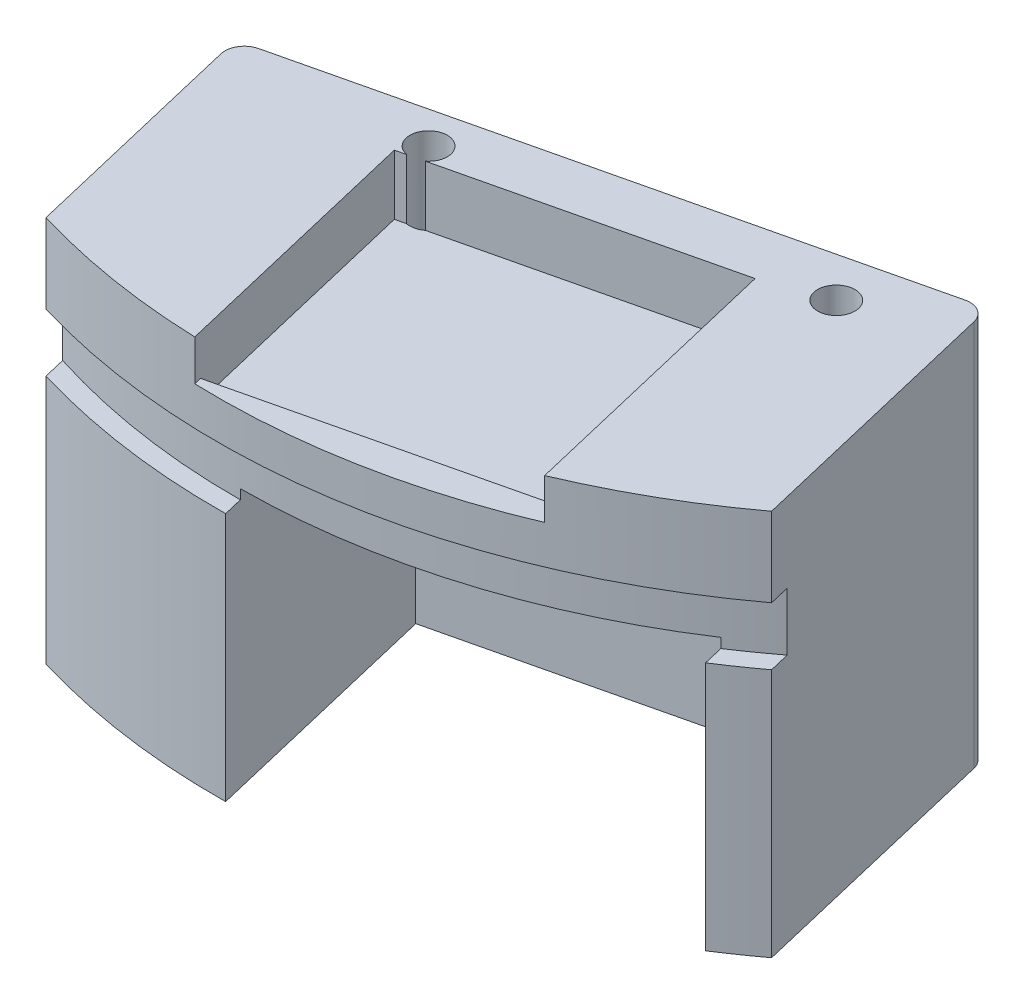
ISO-10303-21;
HEADER;
FILE_DESCRIPTION(('STEP AP214'),'2;1');
FILE_NAME('part.step','',(''),(''),'','','');
FILE_SCHEMA(('AUTOMOTIVE_DESIGN { 1 0 10303 214 1 1 1 1 }'));
ENDSEC;
DATA;
#1=APPLICATION_CONTEXT('core data for automotive mechanical design processes');
#2=APPLICATION_PROTOCOL_DEFINITION('international standard','automotive_design',2000,#1);
#3=PRODUCT_CONTEXT('',#1,'mechanical');
#4=PRODUCT('Part','Part','',(#3));
#5=PRODUCT_RELATED_PRODUCT_CATEGORY('part','',(#4));
#6=PRODUCT_DEFINITION_FORMATION('','',#4);
#7=PRODUCT_DEFINITION_CONTEXT('part definition',#1,'design');
#8=PRODUCT_DEFINITION('design','',#6,#7);
#9=PRODUCT_DEFINITION_SHAPE('','',#8);
#10=(LENGTH_UNIT() NAMED_UNIT(*) SI_UNIT(.MILLI.,.METRE.));
#11=(NAMED_UNIT(*) PLANE_ANGLE_UNIT() SI_UNIT($,.RADIAN.));
#12=(NAMED_UNIT(*) SI_UNIT($,.STERADIAN.) SOLID_ANGLE_UNIT());
#13=UNCERTAINTY_MEASURE_WITH_UNIT(LENGTH_MEASURE(1.E-05),#10,'distance_accuracy_value','');
#14=(GEOMETRIC_REPRESENTATION_CONTEXT(3) GLOBAL_UNCERTAINTY_ASSIGNED_CONTEXT((#13)) GLOBAL_UNIT_ASSIGNED_CONTEXT((#10,
#11,#12)) REPRESENTATION_CONTEXT('',''));
#15=CARTESIAN_POINT('',(0.,0.,0.));
#16=DIRECTION('',(0.,0.,1.));
#17=DIRECTION('',(1.,0.,0.));
#18=AXIS2_PLACEMENT_3D('',#15,#16,#17);
#19=CARTESIAN_POINT('',(0.,50.8,0.));
#20=DIRECTION('',(0.,-1.,0.));
#21=DIRECTION('',(0.,0.,-1.));
#22=AXIS2_PLACEMENT_3D('',#19,#20,#21);
#23=CYLINDRICAL_SURFACE('',#22,91.821);
#24=DIRECTION('',(0.,-1.,0.));
#25=VECTOR('',#24,1.);
#26=CARTESIAN_POINT('',(54.7427548097645,50.8,73.7178868175018));
#27=LINE('',#26,#25);
#28=CARTESIAN_POINT('',(54.7427548097645,0.,73.7178868175018));
#29=VERTEX_POINT('',#28);
#30=CARTESIAN_POINT('',(54.7427548097645,32.766,73.7178868175019));
#31=VERTEX_POINT('',#30);
#32=EDGE_CURVE('E366',#29,#31,#27,.F.);
#33=ORIENTED_EDGE('',*,*,#32,.T.);
#34=CARTESIAN_POINT('',(0.,32.766,0.));
#35=DIRECTION('',(0.,1.,0.));
#36=DIRECTION('',(0.,0.,1.));
#37=AXIS2_PLACEMENT_3D('',#34,#35,#36);
#38=CIRCLE('',#37,91.8210000000001);
#39=CARTESIAN_POINT('',(49.6178804361938,32.766,77.2603519408215));
#40=VERTEX_POINT('',#39);
#41=EDGE_CURVE('E436',#40,#31,#38,.T.);
#42=ORIENTED_EDGE('',*,*,#41,.F.);
#43=DIRECTION('',(0.,-1.,0.));
#44=VECTOR('',#43,1.);
#45=CARTESIAN_POINT('',(49.6178804361938,50.8,77.2603519408214));
#46=LINE('',#45,#44);
#47=CARTESIAN_POINT('',(49.6178804361938,0.,77.2603519408214));
#48=VERTEX_POINT('',#47);
#49=EDGE_CURVE('E302',#40,#48,#46,.T.);
#50=ORIENTED_EDGE('',*,*,#49,.T.);
#51=CARTESIAN_POINT('',(0.,0.,0.));
#52=DIRECTION('',(0.,1.,0.));
#53=DIRECTION('',(0.,0.,1.));
#54=AXIS2_PLACEMENT_3D('',#51,#52,#53);
#55=CIRCLE('',#54,91.821);
#56=EDGE_CURVE('E282',#48,#29,#55,.T.);
#57=ORIENTED_EDGE('',*,*,#56,.T.);
#58=EDGE_LOOP('',(#33,#42,#50,#57));
#59=FACE_BOUND('',#58,.T.);
#60=ADVANCED_FACE('F44',(#59),#23,.T.);
#61=DIRECTION('',(0.,-1.,0.));
#62=VECTOR('',#61,1.);
#63=CARTESIAN_POINT('',(1.12127287191595,50.8,91.814153528455));
#64=LINE('',#63,#62);
#65=CARTESIAN_POINT('',(1.12127287191595,0.,91.814153528455));
#66=VERTEX_POINT('',#65);
#67=CARTESIAN_POINT('',(1.12127287191597,32.766,91.8141535284551));
#68=VERTEX_POINT('',#67);
#69=EDGE_CURVE('E309',#66,#68,#64,.F.);
#70=ORIENTED_EDGE('',*,*,#69,.T.);
#71=CARTESIAN_POINT('',(-26.3260693042562,32.766,87.9660964007584));
#72=VERTEX_POINT('',#71);
#73=EDGE_CURVE('E437',#72,#68,#38,.T.);
#74=ORIENTED_EDGE('',*,*,#73,.F.);
#75=DIRECTION('',(0.,-1.,0.));
#76=VECTOR('',#75,1.);
#77=CARTESIAN_POINT('',(-26.3260693042562,50.8,87.9660964007583));
#78=LINE('',#77,#76);
#79=CARTESIAN_POINT('',(-26.3260693042562,0.,87.9660964007583));
#80=VERTEX_POINT('',#79);
#81=EDGE_CURVE('E274',#72,#80,#78,.T.);
#82=ORIENTED_EDGE('',*,*,#81,.T.);
#83=EDGE_CURVE('E279',#80,#66,#55,.T.);
#84=ORIENTED_EDGE('',*,*,#83,.T.);
#85=EDGE_LOOP('',(#70,#74,#82,#84));
#86=FACE_BOUND('',#85,.T.);
#87=ADVANCED_FACE('F536',(#86),#23,.T.);
#88=CARTESIAN_POINT('',(0.,34.036,0.));
#89=DIRECTION('',(0.,1.,0.));
#90=DIRECTION('',(0.,0.,1.));
#91=AXIS2_PLACEMENT_3D('',#88,#89,#90);
#92=PLANE('',#91);
#93=DIRECTION('',(0.970383203876007,0.,-0.241570771483919));
#94=VECTOR('',#93,1.);
#95=CARTESIAN_POINT('',(4.1266555424623,34.036,64.0245226491388));
#96=LINE('',#95,#94);
#97=CARTESIAN_POINT('',(4.1266555424623,34.036,64.0245226491387));
#98=VERTEX_POINT('',#97);
#99=CARTESIAN_POINT('',(32.4556101842239,34.036,56.9722082636378));
#100=VERTEX_POINT('',#99);
#101=EDGE_CURVE('E329',#98,#100,#96,.T.);
#102=ORIENTED_EDGE('',*,*,#101,.F.);
#103=DIRECTION('',(-0.241570771483919,0.,-0.970383203876007));
#104=VECTOR('',#103,1.);
#105=CARTESIAN_POINT('',(4.1266555424623,34.036,64.0245226491388));
#106=LINE('',#105,#104);
#107=CARTESIAN_POINT('',(8.08996538918475,34.036,79.9450302643238));
#108=VERTEX_POINT('',#107);
#109=EDGE_CURVE('E332',#108,#98,#106,.T.);
#110=ORIENTED_EDGE('',*,*,#109,.F.);
#111=DIRECTION('',(-0.970383203876007,0.,0.241570771483919));
#112=VECTOR('',#111,1.);
#113=CARTESIAN_POINT('',(8.08996538918475,34.036,79.9450302643238));
#114=LINE('',#113,#112);
#115=CARTESIAN_POINT('',(36.4189200309464,34.036,72.8927158788228));
#116=VERTEX_POINT('',#115);
#117=EDGE_CURVE('E322',#116,#108,#114,.T.);
#118=ORIENTED_EDGE('',*,*,#117,.F.);
#119=DIRECTION('',(0.241570771483918,0.,0.970383203876007));
#120=VECTOR('',#119,1.);
#121=CARTESIAN_POINT('',(32.4556101842239,34.036,56.9722082636378));
#122=LINE('',#121,#120);
#123=EDGE_CURVE('E326',#100,#116,#122,.T.);
#124=ORIENTED_EDGE('',*,*,#123,.F.);
#125=EDGE_LOOP('',(#102,#110,#118,#124));
#126=FACE_BOUND('',#125,.T.);
#127=DIRECTION('',(-0.230709787533386,0.,-0.973022607104429));
#128=VECTOR('',#127,1.);
#129=CARTESIAN_POINT('',(29.6330142903222,34.036,-7.02617429541416));
#130=LINE('',#129,#128);
#131=CARTESIAN_POINT('',(48.9956200304582,34.036,74.6359576801355));
#132=VERTEX_POINT('',#131);
#133=CARTESIAN_POINT('',(42.5422488990527,34.036,47.4187508592762));
#134=VERTEX_POINT('',#133);
#135=EDGE_CURVE('E295',#132,#134,#130,.T.);
#136=ORIENTED_EDGE('',*,*,#135,.F.);
#137=CARTESIAN_POINT('',(0.,34.036,0.));
#138=DIRECTION('',(0.,1.,0.));
#139=DIRECTION('',(0.,0.,1.));
#140=AXIS2_PLACEMENT_3D('',#137,#138,#139);
#141=CIRCLE('',#140,89.2810000000001);
#142=CARTESIAN_POINT('',(0.520286764385591,34.036,89.2794839965085));
#143=VERTEX_POINT('',#142);
#144=EDGE_CURVE('E433',#132,#143,#141,.F.);
#145=ORIENTED_EDGE('',*,*,#144,.T.);
#146=DIRECTION('',(0.230709787533386,0.,0.973022607104429));
#147=VECTOR('',#146,1.);
#148=CARTESIAN_POINT('',(-19.5493864083783,34.036,4.63528262524837));
#149=LINE('',#148,#147);
#150=CARTESIAN_POINT('',(-6.64015179964779,34.036,59.0802077799387));
#151=VERTEX_POINT('',#150);
#152=EDGE_CURVE('E292',#151,#143,#149,.T.);
#153=ORIENTED_EDGE('',*,*,#152,.F.);
#154=DIRECTION('',(-0.973022607104429,0.,0.230709787533386));
#155=VECTOR('',#154,1.);
#156=CARTESIAN_POINT('',(12.9092346087305,34.036,54.4449251546903));
#157=LINE('',#156,#155);
#158=EDGE_CURVE('E305',#134,#151,#157,.T.);
#159=ORIENTED_EDGE('',*,*,#158,.F.);
#160=EDGE_LOOP('',(#136,#145,#153,#159));
#161=FACE_BOUND('',#160,.T.);
#162=ADVANCED_FACE('F454',(#126,#161),#92,.F.);
#163=CARTESIAN_POINT('',(-3.21042467012304,42.926,90.7750141052591));
#164=DIRECTION('',(0.230709787533386,0.,0.973022607104429));
#165=DIRECTION('',(0.973022607104429,0.,-0.230709787533386));
#166=AXIS2_PLACEMENT_3D('',#163,#164,#165);
#167=PLANE('',#166);
#168=DIRECTION('',(-0.973022607104429,0.,0.230709787533386));
#169=VECTOR('',#168,1.);
#170=CARTESIAN_POINT('',(-3.21042467012304,45.466,90.7750141052591));
#171=LINE('',#170,#169);
#172=CARTESIAN_POINT('',(35.0974753715783,45.466,81.6919697700697));
#173=VERTEX_POINT('',#172);
#174=CARTESIAN_POINT('',(-3.21042467012304,45.466,90.7750141052591));
#175=VERTEX_POINT('',#174);
#176=EDGE_CURVE('E236',#173,#175,#171,.T.);
#177=ORIENTED_EDGE('',*,*,#176,.F.);
#178=DIRECTION('',(0.,1.,0.));
#179=VECTOR('',#178,1.);
#180=CARTESIAN_POINT('',(35.0974753715783,42.926,81.6919697700697));
#181=LINE('',#180,#179);
#182=CARTESIAN_POINT('',(35.0974753715783,42.926,81.6919697700697));
#183=VERTEX_POINT('',#182);
#184=EDGE_CURVE('E348',#183,#173,#181,.T.);
#185=ORIENTED_EDGE('',*,*,#184,.F.);
#186=DIRECTION('',(0.973022607104429,0.,-0.230709787533386));
#187=VECTOR('',#186,1.);
#188=CARTESIAN_POINT('',(-3.21042467012304,42.926,90.7750141052591));
#189=LINE('',#188,#187);
#190=CARTESIAN_POINT('',(-3.21042467012304,42.926,90.7750141052591));
#191=VERTEX_POINT('',#190);
#192=EDGE_CURVE('E373',#191,#183,#189,.T.);
#193=ORIENTED_EDGE('',*,*,#192,.F.);
#194=DIRECTION('',(0.,1.,0.));
#195=VECTOR('',#194,1.);
#196=CARTESIAN_POINT('',(-3.21042467012304,42.926,90.7750141052591));
#197=LINE('',#196,#195);
#198=EDGE_CURVE('E345',#191,#175,#197,.T.);
#199=ORIENTED_EDGE('',*,*,#198,.T.);
#200=EDGE_LOOP('',(#177,#185,#193,#199));
#201=FACE_BOUND('',#200,.T.);
#202=ADVANCED_FACE('F527',(#201),#167,.F.);
#203=CARTESIAN_POINT('',(27.1864367570585,42.926,48.3270245724588));
#204=DIRECTION('',(-0.230709787533387,0.,-0.973022607104429));
#205=DIRECTION('',(-0.973022607104429,0.,0.230709787533387));
#206=AXIS2_PLACEMENT_3D('',#203,#204,#205);
#207=PLANE('',#206);
#208=DIRECTION('',(-0.973022607104429,0.,0.230709787533387));
#209=VECTOR('',#208,1.);
#210=CARTESIAN_POINT('',(27.1864367570585,42.926,48.3270245724588));
#211=LINE('',#210,#209);
#212=CARTESIAN_POINT('',(-9.82608972966638,42.926,57.1029276804425));
#213=VERTEX_POINT('',#212);
#214=CARTESIAN_POINT('',(-11.1214632846429,42.926,57.4100689076483));
#215=VERTEX_POINT('',#214);
#216=EDGE_CURVE('E369',#213,#215,#211,.T.);
#217=ORIENTED_EDGE('',*,*,#216,.F.);
#218=DIRECTION('',(0.,1.,0.));
#219=VECTOR('',#218,1.);
#220=CARTESIAN_POINT('',(-9.82608972966639,50.8,57.1029276804425));
#221=LINE('',#220,#219);
#222=CARTESIAN_POINT('',(-9.82608972966639,50.8,57.1029276804425));
#223=VERTEX_POINT('',#222);
#224=EDGE_CURVE('E396',#213,#223,#221,.T.);
#225=ORIENTED_EDGE('',*,*,#224,.T.);
#226=DIRECTION('',(-0.973022607104429,0.,0.230709787533387));
#227=VECTOR('',#226,1.);
#228=CARTESIAN_POINT('',(27.1864367570585,50.8,48.3270245724588));
#229=LINE('',#228,#227);
#230=CARTESIAN_POINT('',(-11.1214632846429,50.8,57.4100689076483));
#231=VERTEX_POINT('',#230);
#232=EDGE_CURVE('E361',#223,#231,#229,.T.);
#233=ORIENTED_EDGE('',*,*,#232,.T.);
#234=DIRECTION('',(0.,1.,0.));
#235=VECTOR('',#234,1.);
#236=CARTESIAN_POINT('',(-11.1214632846429,42.926,57.4100689076483));
#237=LINE('',#236,#235);
#238=EDGE_CURVE('E334',#215,#231,#237,.T.);
#239=ORIENTED_EDGE('',*,*,#238,.F.);
#240=EDGE_LOOP('',(#217,#225,#233,#239));
#241=FACE_BOUND('',#240,.T.);
#242=ADVANCED_FACE('F509',(#241),#207,.F.);
#243=CARTESIAN_POINT('',(0.,0.,0.));
#244=DIRECTION('',(0.,1.,0.));
#245=DIRECTION('',(0.,0.,1.));
#246=AXIS2_PLACEMENT_3D('',#243,#244,#245);
#247=PLANE('',#246);
#248=CARTESIAN_POINT('',(-9.33617301887164,0.,54.6948076421172));
#249=DIRECTION('',(0.,1.,0.));
#250=DIRECTION('',(0.,0.,1.));
#251=AXIS2_PLACEMENT_3D('',#248,#249,#250);
#252=CIRCLE('',#251,2.45744999999998);
#253=CARTESIAN_POINT('',(-9.33617301887164,0.,57.1522576421172));
#254=VERTEX_POINT('',#253);
#255=EDGE_CURVE('E402',#254,#254,#252,.T.);
#256=ORIENTED_EDGE('',*,*,#255,.T.);
#257=EDGE_LOOP('',(#256));
#258=FACE_BOUND('',#257,.T.);
#259=CARTESIAN_POINT('',(34.9923344592376,0.,45.4676527439476));
#260=DIRECTION('',(0.,1.,0.));
#261=DIRECTION('',(0.,0.,1.));
#262=AXIS2_PLACEMENT_3D('',#259,#260,#261);
#263=CIRCLE('',#262,2.45744999999998);
#264=CARTESIAN_POINT('',(34.9923344592376,0.,47.9251027439476));
#265=VERTEX_POINT('',#264);
#266=EDGE_CURVE('E386',#265,#265,#263,.T.);
#267=ORIENTED_EDGE('',*,*,#266,.T.);
#268=EDGE_LOOP('',(#267));
#269=FACE_BOUND('',#268,.T.);
#270=DIRECTION('',(0.230709787533386,0.,0.973022607104429));
#271=VECTOR('',#270,1.);
#272=CARTESIAN_POINT('',(-35.8757033345835,0.,47.6903460720576));
#273=LINE('',#272,#271);
#274=CARTESIAN_POINT('',(-33.4730916072108,0.,57.8234035024431));
#275=VERTEX_POINT('',#274);
#276=EDGE_CURVE('E275',#275,#80,#273,.T.);
#277=ORIENTED_EDGE('',*,*,#276,.F.);
#278=CARTESIAN_POINT('',(-31.0016141851656,0.,57.2374006421082));
#279=DIRECTION('',(0.,1.,0.));
#280=DIRECTION('',(0.,0.,1.));
#281=AXIS2_PLACEMENT_3D('',#278,#279,#280);
#282=CIRCLE('',#281,2.54);
#283=CARTESIAN_POINT('',(-31.5876170455004,0.,54.765923220063));
#284=VERTEX_POINT('',#283);
#285=EDGE_CURVE('E262',#275,#284,#282,.F.);
#286=ORIENTED_EDGE('',*,*,#285,.T.);
#287=DIRECTION('',(0.973022607104429,0.,-0.230709787533386));
#288=VECTOR('',#287,1.);
#289=CARTESIAN_POINT('',(45.8932001356174,0.,36.3947335485672));
#290=LINE('',#289,#288);
#291=CARTESIAN_POINT('',(43.4217227135721,0.,36.980736408902));
#292=VERTEX_POINT('',#291);
#293=EDGE_CURVE('E382',#284,#292,#290,.T.);
#294=ORIENTED_EDGE('',*,*,#293,.T.);
#295=CARTESIAN_POINT('',(44.0077255739069,0.,39.4522138309473));
#296=DIRECTION('',(0.,1.,0.));
#297=DIRECTION('',(0.,0.,1.));
#298=AXIS2_PLACEMENT_3D('',#295,#296,#297);
#299=CIRCLE('',#298,2.54);
#300=CARTESIAN_POINT('',(46.4792029959521,0.,38.8662109706125));
#301=VERTEX_POINT('',#300);
#302=EDGE_CURVE('E264',#292,#301,#299,.F.);
#303=ORIENTED_EDGE('',*,*,#302,.T.);
#304=DIRECTION('',(0.230709787533386,0.,0.973022607104429));
#305=VECTOR('',#304,1.);
#306=CARTESIAN_POINT('',(45.8932001356174,0.,36.3947335485672));
#307=LINE('',#306,#305);
#308=EDGE_CURVE('E387',#301,#29,#307,.T.);
#309=ORIENTED_EDGE('',*,*,#308,.T.);
#310=ORIENTED_EDGE('',*,*,#56,.F.);
#311=DIRECTION('',(-0.230709787533386,0.,-0.973022607104429));
#312=VECTOR('',#311,1.);
#313=CARTESIAN_POINT('',(29.6330142903222,0.,-7.02617429541416));
#314=LINE('',#313,#312);
#315=CARTESIAN_POINT('',(42.5422488990527,0.,47.4187508592762));
#316=VERTEX_POINT('',#315);
#317=EDGE_CURVE('E299',#48,#316,#314,.T.);
#318=ORIENTED_EDGE('',*,*,#317,.T.);
#319=DIRECTION('',(-0.973022607104429,0.,0.230709787533386));
#320=VECTOR('',#319,1.);
#321=CARTESIAN_POINT('',(12.9092346087305,0.,54.4449251546903));
#322=LINE('',#321,#320);
#323=CARTESIAN_POINT('',(-6.64015179964779,0.,59.0802077799387));
#324=VERTEX_POINT('',#323);
#325=EDGE_CURVE('E296',#316,#324,#322,.T.);
#326=ORIENTED_EDGE('',*,*,#325,.T.);
#327=DIRECTION('',(0.230709787533386,0.,0.973022607104429));
#328=VECTOR('',#327,1.);
#329=CARTESIAN_POINT('',(-19.5493864083783,0.,4.63528262524837));
#330=LINE('',#329,#328);
#331=EDGE_CURVE('E293',#324,#66,#330,.T.);
#332=ORIENTED_EDGE('',*,*,#331,.T.);
#333=ORIENTED_EDGE('',*,*,#83,.F.);
#334=EDGE_LOOP('',(#277,#286,#294,#303,#309,#310,#318,#326,#332,#333));
#335=FACE_BOUND('',#334,.T.);
#336=ADVANCED_FACE('F534',(#258,#269,#335),#247,.F.);
#337=CARTESIAN_POINT('',(-26.3260693042562,50.8,87.9660964007583));
#338=VERTEX_POINT('',#337);
#339=CARTESIAN_POINT('',(-26.3260693042562,40.386,87.9660964007584));
#340=VERTEX_POINT('',#339);
#341=EDGE_CURVE('E271',#338,#340,#78,.T.);
#342=ORIENTED_EDGE('',*,*,#341,.T.);
#343=CARTESIAN_POINT('',(0.,40.386,0.));
#344=DIRECTION('',(0.,1.,0.));
#345=DIRECTION('',(0.,0.,1.));
#346=AXIS2_PLACEMENT_3D('',#343,#344,#345);
#347=CIRCLE('',#346,91.8210000000001);
#348=CARTESIAN_POINT('',(54.7427548097646,40.386,73.7178868175019));
#349=VERTEX_POINT('',#348);
#350=EDGE_CURVE('E243',#340,#349,#347,.T.);
#351=ORIENTED_EDGE('',*,*,#350,.T.);
#352=CARTESIAN_POINT('',(54.7427548097645,50.8,73.7178868175018));
#353=VERTEX_POINT('',#352);
#354=EDGE_CURVE('E248',#349,#353,#27,.F.);
#355=ORIENTED_EDGE('',*,*,#354,.T.);
#356=CARTESIAN_POINT('',(0.,50.8,0.));
#357=DIRECTION('',(0.,1.,0.));
#358=DIRECTION('',(0.,0.,1.));
#359=AXIS2_PLACEMENT_3D('',#356,#357,#358);
#360=CIRCLE('',#359,91.821);
#361=CARTESIAN_POINT('',(35.7783605088858,50.8,84.5636148724509));
#362=VERTEX_POINT('',#361);
#363=EDGE_CURVE('E278',#362,#353,#360,.T.);
#364=ORIENTED_EDGE('',*,*,#363,.F.);
#365=DIRECTION('',(0.,-1.,0.));
#366=VECTOR('',#365,1.);
#367=CARTESIAN_POINT('',(35.7783605088858,50.8,84.5636148724509));
#368=LINE('',#367,#366);
#369=CARTESIAN_POINT('',(35.7783605088858,45.466,84.5636148724509));
#370=VERTEX_POINT('',#369);
#371=EDGE_CURVE('E410',#362,#370,#368,.T.);
#372=ORIENTED_EDGE('',*,*,#371,.T.);
#373=CARTESIAN_POINT('',(0.,45.466,0.));
#374=DIRECTION('',(0.,1.,0.));
#375=DIRECTION('',(0.,0.,1.));
#376=AXIS2_PLACEMENT_3D('',#373,#374,#375);
#377=CIRCLE('',#376,91.821);
#378=CARTESIAN_POINT('',(-2.97383622127054,45.466,91.7728300703921));
#379=VERTEX_POINT('',#378);
#380=EDGE_CURVE('E413',#379,#370,#377,.T.);
#381=ORIENTED_EDGE('',*,*,#380,.F.);
#382=DIRECTION('',(0.,-1.,0.));
#383=VECTOR('',#382,1.);
#384=CARTESIAN_POINT('',(-2.97383622127054,50.8,91.7728300703921));
#385=LINE('',#384,#383);
#386=CARTESIAN_POINT('',(-2.97383622127054,50.8,91.7728300703921));
#387=VERTEX_POINT('',#386);
#388=EDGE_CURVE('E407',#379,#387,#385,.F.);
#389=ORIENTED_EDGE('',*,*,#388,.T.);
#390=EDGE_CURVE('E285',#338,#387,#360,.T.);
#391=ORIENTED_EDGE('',*,*,#390,.F.);
#392=EDGE_LOOP('',(#342,#351,#355,#364,#372,#381,#389,#391));
#393=FACE_BOUND('',#392,.T.);
#394=ADVANCED_FACE('F497',(#393),#23,.T.);
#395=CARTESIAN_POINT('',(-35.8757033345835,50.8,47.6903460720576));
#396=DIRECTION('',(0.973022607104429,0.,-0.230709787533386));
#397=DIRECTION('',(-0.230709787533386,0.,-0.973022607104429));
#398=AXIS2_PLACEMENT_3D('',#395,#396,#397);
#399=PLANE('',#398);
#400=ORIENTED_EDGE('',*,*,#81,.F.);
#401=DIRECTION('',(-0.230709787533386,0.,-0.973022607104429));
#402=VECTOR('',#401,1.);
#403=CARTESIAN_POINT('',(-35.8757033345835,32.766,47.6903460720576));
#404=LINE('',#403,#402);
#405=CARTESIAN_POINT('',(-27.0059665665814,32.766,85.0986176785775));
#406=VERTEX_POINT('',#405);
#407=EDGE_CURVE('E419',#72,#406,#404,.T.);
#408=ORIENTED_EDGE('',*,*,#407,.T.);
#409=DIRECTION('',(0.,1.,0.));
#410=VECTOR('',#409,1.);
#411=CARTESIAN_POINT('',(-27.0059665665814,50.8,85.0986176785775));
#412=LINE('',#411,#410);
#413=CARTESIAN_POINT('',(-27.0059665665814,40.386,85.0986176785775));
#414=VERTEX_POINT('',#413);
#415=EDGE_CURVE('E427',#406,#414,#412,.T.);
#416=ORIENTED_EDGE('',*,*,#415,.T.);
#417=DIRECTION('',(0.230709787533386,0.,0.973022607104429));
#418=VECTOR('',#417,1.);
#419=CARTESIAN_POINT('',(-35.8757033345835,40.386,47.6903460720576));
#420=LINE('',#419,#418);
#421=EDGE_CURVE('E242',#414,#340,#420,.T.);
#422=ORIENTED_EDGE('',*,*,#421,.T.);
#423=ORIENTED_EDGE('',*,*,#341,.F.);
#424=DIRECTION('',(0.230709787533386,0.,0.973022607104429));
#425=VECTOR('',#424,1.);
#426=CARTESIAN_POINT('',(-35.8757033345835,50.8,47.6903460720576));
#427=LINE('',#426,#425);
#428=CARTESIAN_POINT('',(-33.4730916072108,50.8,57.8234035024431));
#429=VERTEX_POINT('',#428);
#430=EDGE_CURVE('E283',#429,#338,#427,.T.);
#431=ORIENTED_EDGE('',*,*,#430,.F.);
#432=DIRECTION('',(0.,-1.,0.));
#433=VECTOR('',#432,1.);
#434=CARTESIAN_POINT('',(-33.4730916072108,50.8,57.823403502443));
#435=LINE('',#434,#433);
#436=EDGE_CURVE('E266',#429,#275,#435,.T.);
#437=ORIENTED_EDGE('',*,*,#436,.T.);
#438=ORIENTED_EDGE('',*,*,#276,.T.);
#439=EDGE_LOOP('',(#400,#408,#416,#422,#423,#431,#437,#438));
#440=FACE_BOUND('',#439,.T.);
#441=ADVANCED_FACE('F493',(#440),#399,.F.);
#442=CARTESIAN_POINT('',(0.,50.8,0.));
#443=DIRECTION('',(0.,1.,0.));
#444=DIRECTION('',(0.,0.,1.));
#445=AXIS2_PLACEMENT_3D('',#442,#443,#444);
#446=PLANE('',#445);
#447=ORIENTED_EDGE('',*,*,#390,.T.);
#448=DIRECTION('',(0.230709787533387,0.,0.973022607104429));
#449=VECTOR('',#448,1.);
#450=CARTESIAN_POINT('',(-11.1214632846429,50.8,57.4100689076483));
#451=LINE('',#450,#449);
#452=EDGE_CURVE('E364',#231,#387,#451,.T.);
#453=ORIENTED_EDGE('',*,*,#452,.F.);
#454=ORIENTED_EDGE('',*,*,#232,.F.);
#455=CARTESIAN_POINT('',(-9.33617301887164,50.8,54.6948076421172));
#456=DIRECTION('',(0.,1.,0.));
#457=DIRECTION('',(0.,0.,1.));
#458=AXIS2_PLACEMENT_3D('',#455,#456,#457);
#459=CIRCLE('',#458,2.45744999999999);
#460=CARTESIAN_POINT('',(-7.81723221335653,50.8,56.6266149130014));
#461=VERTEX_POINT('',#460);
#462=EDGE_CURVE('E405',#461,#223,#459,.T.);
#463=ORIENTED_EDGE('',*,*,#462,.F.);
#464=CARTESIAN_POINT('',(27.1864367570585,50.8,48.3270245724588));
#465=VERTEX_POINT('',#464);
#466=EDGE_CURVE('E357',#465,#461,#229,.T.);
#467=ORIENTED_EDGE('',*,*,#466,.F.);
#468=DIRECTION('',(-0.230709787533387,0.,-0.973022607104429));
#469=VECTOR('',#468,1.);
#470=CARTESIAN_POINT('',(35.0974753715783,50.8,81.6919697700697));
#471=LINE('',#470,#469);
#472=EDGE_CURVE('E362',#362,#465,#471,.T.);
#473=ORIENTED_EDGE('',*,*,#472,.F.);
#474=ORIENTED_EDGE('',*,*,#363,.T.);
#475=DIRECTION('',(0.230709787533386,0.,0.973022607104429));
#476=VECTOR('',#475,1.);
#477=CARTESIAN_POINT('',(45.8932001356174,50.8,36.3947335485672));
#478=LINE('',#477,#476);
#479=CARTESIAN_POINT('',(46.4792029959521,50.8,38.8662109706125));
#480=VERTEX_POINT('',#479);
#481=EDGE_CURVE('E380',#480,#353,#478,.T.);
#482=ORIENTED_EDGE('',*,*,#481,.F.);
#483=CARTESIAN_POINT('',(44.0077255739069,50.8,39.4522138309473));
#484=DIRECTION('',(0.,1.,0.));
#485=DIRECTION('',(0.,0.,1.));
#486=AXIS2_PLACEMENT_3D('',#483,#484,#485);
#487=CIRCLE('',#486,2.54);
#488=CARTESIAN_POINT('',(43.4217227135721,50.8,36.980736408902));
#489=VERTEX_POINT('',#488);
#490=EDGE_CURVE('E256',#480,#489,#487,.T.);
#491=ORIENTED_EDGE('',*,*,#490,.T.);
#492=DIRECTION('',(0.973022607104429,0.,-0.230709787533386));
#493=VECTOR('',#492,1.);
#494=CARTESIAN_POINT('',(45.8932001356174,50.8,36.3947335485672));
#495=LINE('',#494,#493);
#496=CARTESIAN_POINT('',(-31.5876170455004,50.8,54.765923220063));
#497=VERTEX_POINT('',#496);
#498=EDGE_CURVE('E383',#497,#489,#495,.T.);
#499=ORIENTED_EDGE('',*,*,#498,.F.);
#500=CARTESIAN_POINT('',(-31.0016141851656,50.8,57.2374006421082));
#501=DIRECTION('',(0.,1.,0.));
#502=DIRECTION('',(0.,0.,1.));
#503=AXIS2_PLACEMENT_3D('',#500,#501,#502);
#504=CIRCLE('',#503,2.54);
#505=EDGE_CURVE('E254',#497,#429,#504,.T.);
#506=ORIENTED_EDGE('',*,*,#505,.T.);
#507=ORIENTED_EDGE('',*,*,#430,.T.);
#508=EDGE_LOOP('',(#447,#453,#454,#463,#467,#473,#474,#482,#491,#499,#506,#507));
#509=FACE_BOUND('',#508,.T.);
#510=CARTESIAN_POINT('',(34.9923344592376,50.8,45.4676527439476));
#511=DIRECTION('',(0.,1.,0.));
#512=DIRECTION('',(0.,0.,1.));
#513=AXIS2_PLACEMENT_3D('',#510,#511,#512);
#514=CIRCLE('',#513,2.45744999999999);
#515=CARTESIAN_POINT('',(34.9923344592376,50.8,47.9251027439476));
#516=VERTEX_POINT('',#515);
#517=EDGE_CURVE('E393',#516,#516,#514,.T.);
#518=ORIENTED_EDGE('',*,*,#517,.F.);
#519=EDGE_LOOP('',(#518));
#520=FACE_BOUND('',#519,.T.);
#521=ADVANCED_FACE('F478',(#509,#520),#446,.T.);
#522=CARTESIAN_POINT('',(29.6330142903222,34.036,-7.02617429541416));
#523=DIRECTION('',(-0.973022607104429,0.,0.230709787533386));
#524=DIRECTION('',(0.230709787533386,0.,0.973022607104429));
#525=AXIS2_PLACEMENT_3D('',#522,#523,#524);
#526=PLANE('',#525);
#527=DIRECTION('',(0.230709787533386,0.,0.973022607104429));
#528=VECTOR('',#527,1.);
#529=CARTESIAN_POINT('',(29.6330142903222,32.766,-7.02617429541416));
#530=LINE('',#529,#528);
#531=CARTESIAN_POINT('',(48.9956200304582,32.766,74.6359576801355));
#532=VERTEX_POINT('',#531);
#533=EDGE_CURVE('E422',#532,#40,#530,.T.);
#534=ORIENTED_EDGE('',*,*,#533,.F.);
#535=DIRECTION('',(0.,1.,0.));
#536=VECTOR('',#535,1.);
#537=CARTESIAN_POINT('',(48.9956200304582,50.8,74.6359576801355));
#538=LINE('',#537,#536);
#539=EDGE_CURVE('E429',#132,#532,#538,.F.);
#540=ORIENTED_EDGE('',*,*,#539,.F.);
#541=ORIENTED_EDGE('',*,*,#135,.T.);
#542=DIRECTION('',(0.,-1.,0.));
#543=VECTOR('',#542,1.);
#544=CARTESIAN_POINT('',(42.5422488990527,34.036,47.4187508592762));
#545=LINE('',#544,#543);
#546=EDGE_CURVE('E288',#134,#316,#545,.T.);
#547=ORIENTED_EDGE('',*,*,#546,.T.);
#548=ORIENTED_EDGE('',*,*,#317,.F.);
#549=ORIENTED_EDGE('',*,*,#49,.F.);
#550=EDGE_LOOP('',(#534,#540,#541,#547,#548,#549));
#551=FACE_BOUND('',#550,.T.);
#552=ADVANCED_FACE('F458',(#551),#526,.T.);
#553=CARTESIAN_POINT('',(12.9092346087305,34.036,54.4449251546903));
#554=DIRECTION('',(0.230709787533386,0.,0.973022607104429));
#555=DIRECTION('',(0.973022607104429,0.,-0.230709787533386));
#556=AXIS2_PLACEMENT_3D('',#553,#554,#555);
#557=PLANE('',#556);
#558=ORIENTED_EDGE('',*,*,#325,.F.);
#559=ORIENTED_EDGE('',*,*,#546,.F.);
#560=ORIENTED_EDGE('',*,*,#158,.T.);
#561=DIRECTION('',(0.,-1.,0.));
#562=VECTOR('',#561,1.);
#563=CARTESIAN_POINT('',(-6.64015179964779,34.036,59.0802077799387));
#564=LINE('',#563,#562);
#565=EDGE_CURVE('E290',#151,#324,#564,.T.);
#566=ORIENTED_EDGE('',*,*,#565,.T.);
#567=EDGE_LOOP('',(#558,#559,#560,#566));
#568=FACE_BOUND('',#567,.T.);
#569=ADVANCED_FACE('F563',(#568),#557,.T.);
#570=CARTESIAN_POINT('',(-19.5493864083783,34.036,4.63528262524837));
#571=DIRECTION('',(0.973022607104429,0.,-0.230709787533386));
#572=DIRECTION('',(-0.230709787533386,0.,-0.973022607104429));
#573=AXIS2_PLACEMENT_3D('',#570,#571,#572);
#574=PLANE('',#573);
#575=DIRECTION('',(-0.230709787533386,0.,-0.973022607104429));
#576=VECTOR('',#575,1.);
#577=CARTESIAN_POINT('',(-19.5493864083783,32.766,4.63528262524837));
#578=LINE('',#577,#576);
#579=CARTESIAN_POINT('',(0.520286764385598,32.766,89.2794839965085));
#580=VERTEX_POINT('',#579);
#581=EDGE_CURVE('E424',#68,#580,#578,.T.);
#582=ORIENTED_EDGE('',*,*,#581,.F.);
#583=ORIENTED_EDGE('',*,*,#69,.F.);
#584=ORIENTED_EDGE('',*,*,#331,.F.);
#585=ORIENTED_EDGE('',*,*,#565,.F.);
#586=ORIENTED_EDGE('',*,*,#152,.T.);
#587=DIRECTION('',(0.,1.,0.));
#588=VECTOR('',#587,1.);
#589=CARTESIAN_POINT('',(0.520286764385598,50.8,89.2794839965085));
#590=LINE('',#589,#588);
#591=EDGE_CURVE('E431',#580,#143,#590,.T.);
#592=ORIENTED_EDGE('',*,*,#591,.F.);
#593=EDGE_LOOP('',(#582,#583,#584,#585,#586,#592));
#594=FACE_BOUND('',#593,.T.);
#595=ADVANCED_FACE('F446',(#594),#574,.T.);
#596=CARTESIAN_POINT('',(4.1266555424623,36.576,64.0245226491388));
#597=DIRECTION('',(-0.970383203876007,0.,0.241570771483919));
#598=DIRECTION('',(0.241570771483919,0.,0.970383203876007));
#599=AXIS2_PLACEMENT_3D('',#596,#597,#598);
#600=PLANE('',#599);
#601=ORIENTED_EDGE('',*,*,#109,.T.);
#602=DIRECTION('',(0.,-1.,0.));
#603=VECTOR('',#602,1.);
#604=CARTESIAN_POINT('',(4.1266555424623,36.576,64.0245226491388));
#605=LINE('',#604,#603);
#606=CARTESIAN_POINT('',(4.1266555424623,36.576,64.0245226491388));
#607=VERTEX_POINT('',#606);
#608=EDGE_CURVE('E313',#607,#98,#605,.T.);
#609=ORIENTED_EDGE('',*,*,#608,.F.);
#610=DIRECTION('',(-0.241570771483919,0.,-0.970383203876007));
#611=VECTOR('',#610,1.);
#612=CARTESIAN_POINT('',(4.1266555424623,36.576,64.0245226491388));
#613=LINE('',#612,#611);
#614=CARTESIAN_POINT('',(8.08996538918475,36.576,79.9450302643238));
#615=VERTEX_POINT('',#614);
#616=EDGE_CURVE('E325',#615,#607,#613,.T.);
#617=ORIENTED_EDGE('',*,*,#616,.F.);
#618=DIRECTION('',(0.,-1.,0.));
#619=VECTOR('',#618,1.);
#620=CARTESIAN_POINT('',(8.08996538918475,36.576,79.9450302643238));
#621=LINE('',#620,#619);
#622=EDGE_CURVE('E312',#615,#108,#621,.T.);
#623=ORIENTED_EDGE('',*,*,#622,.T.);
#624=EDGE_LOOP('',(#601,#609,#617,#623));
#625=FACE_BOUND('',#624,.T.);
#626=ADVANCED_FACE('F568',(#625),#600,.F.);
#627=CARTESIAN_POINT('',(8.08996538918475,36.576,79.9450302643238));
#628=DIRECTION('',(0.241570771483919,0.,0.970383203876007));
#629=DIRECTION('',(0.970383203876007,0.,-0.241570771483919));
#630=AXIS2_PLACEMENT_3D('',#627,#628,#629);
#631=PLANE('',#630);
#632=ORIENTED_EDGE('',*,*,#117,.T.);
#633=ORIENTED_EDGE('',*,*,#622,.F.);
#634=DIRECTION('',(-0.970383203876007,0.,0.241570771483919));
#635=VECTOR('',#634,1.);
#636=CARTESIAN_POINT('',(8.08996538918475,36.576,79.9450302643238));
#637=LINE('',#636,#635);
#638=CARTESIAN_POINT('',(36.4189200309464,36.576,72.8927158788228));
#639=VERTEX_POINT('',#638);
#640=EDGE_CURVE('E317',#639,#615,#637,.T.);
#641=ORIENTED_EDGE('',*,*,#640,.F.);
#642=DIRECTION('',(0.,-1.,0.));
#643=VECTOR('',#642,1.);
#644=CARTESIAN_POINT('',(36.4189200309464,36.576,72.8927158788228));
#645=LINE('',#644,#643);
#646=EDGE_CURVE('E319',#639,#116,#645,.T.);
#647=ORIENTED_EDGE('',*,*,#646,.T.);
#648=EDGE_LOOP('',(#632,#633,#641,#647));
#649=FACE_BOUND('',#648,.T.);
#650=ADVANCED_FACE('F572',(#649),#631,.F.);
#651=CARTESIAN_POINT('',(32.4556101842239,36.576,56.9722082636378));
#652=DIRECTION('',(0.970383203876007,0.,-0.241570771483918));
#653=DIRECTION('',(-0.241570771483918,0.,-0.970383203876007));
#654=AXIS2_PLACEMENT_3D('',#651,#652,#653);
#655=PLANE('',#654);
#656=ORIENTED_EDGE('',*,*,#123,.T.);
#657=ORIENTED_EDGE('',*,*,#646,.F.);
#658=DIRECTION('',(0.241570771483918,0.,0.970383203876007));
#659=VECTOR('',#658,1.);
#660=CARTESIAN_POINT('',(32.4556101842239,36.576,56.9722082636378));
#661=LINE('',#660,#659);
#662=CARTESIAN_POINT('',(32.4556101842239,36.576,56.9722082636378));
#663=VERTEX_POINT('',#662);
#664=EDGE_CURVE('E337',#663,#639,#661,.T.);
#665=ORIENTED_EDGE('',*,*,#664,.F.);
#666=DIRECTION('',(0.,-1.,0.));
#667=VECTOR('',#666,1.);
#668=CARTESIAN_POINT('',(32.4556101842239,36.576,56.9722082636378));
#669=LINE('',#668,#667);
#670=EDGE_CURVE('E316',#663,#100,#669,.T.);
#671=ORIENTED_EDGE('',*,*,#670,.T.);
#672=EDGE_LOOP('',(#656,#657,#665,#671));
#673=FACE_BOUND('',#672,.T.);
#674=ADVANCED_FACE('F578',(#673),#655,.F.);
#675=CARTESIAN_POINT('',(4.1266555424623,36.576,64.0245226491388));
#676=DIRECTION('',(-0.241570771483919,0.,-0.970383203876007));
#677=DIRECTION('',(-0.970383203876007,0.,0.241570771483919));
#678=AXIS2_PLACEMENT_3D('',#675,#676,#677);
#679=PLANE('',#678);
#680=ORIENTED_EDGE('',*,*,#101,.T.);
#681=ORIENTED_EDGE('',*,*,#670,.F.);
#682=DIRECTION('',(0.970383203876007,0.,-0.241570771483919));
#683=VECTOR('',#682,1.);
#684=CARTESIAN_POINT('',(4.1266555424623,36.576,64.0245226491388));
#685=LINE('',#684,#683);
#686=EDGE_CURVE('E340',#607,#663,#685,.T.);
#687=ORIENTED_EDGE('',*,*,#686,.F.);
#688=ORIENTED_EDGE('',*,*,#608,.T.);
#689=EDGE_LOOP('',(#680,#681,#687,#688));
#690=FACE_BOUND('',#689,.T.);
#691=ADVANCED_FACE('F574',(#690),#679,.F.);
#692=CARTESIAN_POINT('',(0.,36.576,0.));
#693=DIRECTION('',(0.,1.,0.));
#694=DIRECTION('',(0.,0.,1.));
#695=AXIS2_PLACEMENT_3D('',#692,#693,#694);
#696=PLANE('',#695);
#697=ORIENTED_EDGE('',*,*,#616,.T.);
#698=ORIENTED_EDGE('',*,*,#686,.T.);
#699=ORIENTED_EDGE('',*,*,#664,.T.);
#700=ORIENTED_EDGE('',*,*,#640,.T.);
#701=EDGE_LOOP('',(#697,#698,#699,#700));
#702=FACE_BOUND('',#701,.T.);
#703=ADVANCED_FACE('F577',(#702),#696,.F.);
#704=CARTESIAN_POINT('',(-11.1214632846429,42.926,57.4100689076483));
#705=DIRECTION('',(-0.973022607104429,0.,0.230709787533387));
#706=DIRECTION('',(0.230709787533387,0.,0.973022607104429));
#707=AXIS2_PLACEMENT_3D('',#704,#705,#706);
#708=PLANE('',#707);
#709=ORIENTED_EDGE('',*,*,#452,.T.);
#710=ORIENTED_EDGE('',*,*,#388,.F.);
#711=DIRECTION('',(-0.230709787533387,0.,-0.973022607104429));
#712=VECTOR('',#711,1.);
#713=CARTESIAN_POINT('',(-5.28783791550234,45.466,82.0134870211092));
#714=LINE('',#713,#712);
#715=EDGE_CURVE('E415',#379,#175,#714,.T.);
#716=ORIENTED_EDGE('',*,*,#715,.T.);
#717=ORIENTED_EDGE('',*,*,#198,.F.);
#718=DIRECTION('',(0.230709787533387,0.,0.973022607104429));
#719=VECTOR('',#718,1.);
#720=CARTESIAN_POINT('',(-11.1214632846429,42.926,57.4100689076483));
#721=LINE('',#720,#719);
#722=EDGE_CURVE('E360',#215,#191,#721,.T.);
#723=ORIENTED_EDGE('',*,*,#722,.F.);
#724=ORIENTED_EDGE('',*,*,#238,.T.);
#725=EDGE_LOOP('',(#709,#710,#716,#717,#723,#724));
#726=FACE_BOUND('',#725,.T.);
#727=ADVANCED_FACE('F503',(#726),#708,.F.);
#728=ORIENTED_EDGE('',*,*,#466,.T.);
#729=DIRECTION('',(0.,1.,0.));
#730=VECTOR('',#729,1.);
#731=CARTESIAN_POINT('',(-7.81723221335654,50.8,56.6266149130014));
#732=LINE('',#731,#730);
#733=CARTESIAN_POINT('',(-7.81723221335654,42.926,56.6266149130014));
#734=VERTEX_POINT('',#733);
#735=EDGE_CURVE('E399',#461,#734,#732,.F.);
#736=ORIENTED_EDGE('',*,*,#735,.T.);
#737=CARTESIAN_POINT('',(27.1864367570585,42.926,48.3270245724588));
#738=VERTEX_POINT('',#737);
#739=EDGE_CURVE('E349',#738,#734,#211,.T.);
#740=ORIENTED_EDGE('',*,*,#739,.F.);
#741=DIRECTION('',(0.,1.,0.));
#742=VECTOR('',#741,1.);
#743=CARTESIAN_POINT('',(27.1864367570585,42.926,48.3270245724588));
#744=LINE('',#743,#742);
#745=EDGE_CURVE('E352',#738,#465,#744,.T.);
#746=ORIENTED_EDGE('',*,*,#745,.T.);
#747=EDGE_LOOP('',(#728,#736,#740,#746));
#748=FACE_BOUND('',#747,.T.);
#749=ADVANCED_FACE('F518',(#748),#207,.F.);
#750=CARTESIAN_POINT('',(35.0974753715783,42.926,81.6919697700697));
#751=DIRECTION('',(0.973022607104429,0.,-0.230709787533387));
#752=DIRECTION('',(-0.230709787533387,0.,-0.973022607104429));
#753=AXIS2_PLACEMENT_3D('',#750,#751,#752);
#754=PLANE('',#753);
#755=ORIENTED_EDGE('',*,*,#472,.T.);
#756=ORIENTED_EDGE('',*,*,#745,.F.);
#757=DIRECTION('',(-0.230709787533387,0.,-0.973022607104429));
#758=VECTOR('',#757,1.);
#759=CARTESIAN_POINT('',(35.0974753715783,42.926,81.6919697700697));
#760=LINE('',#759,#758);
#761=EDGE_CURVE('E370',#183,#738,#760,.T.);
#762=ORIENTED_EDGE('',*,*,#761,.F.);
#763=ORIENTED_EDGE('',*,*,#184,.T.);
#764=DIRECTION('',(0.230709787533386,0.,0.973022607104429));
#765=VECTOR('',#764,1.);
#766=CARTESIAN_POINT('',(33.020062126199,45.466,72.9304426859198));
#767=LINE('',#766,#765);
#768=EDGE_CURVE('E67',#173,#370,#767,.T.);
#769=ORIENTED_EDGE('',*,*,#768,.T.);
#770=ORIENTED_EDGE('',*,*,#371,.F.);
#771=EDGE_LOOP('',(#755,#756,#762,#763,#769,#770));
#772=FACE_BOUND('',#771,.T.);
#773=ADVANCED_FACE('F523',(#772),#754,.F.);
#774=CARTESIAN_POINT('',(0.,42.926,0.));
#775=DIRECTION('',(0.,1.,0.));
#776=DIRECTION('',(0.,0.,1.));
#777=AXIS2_PLACEMENT_3D('',#774,#775,#776);
#778=PLANE('',#777);
#779=CARTESIAN_POINT('',(-9.33617301887164,42.926,54.6948076421172));
#780=DIRECTION('',(0.,1.,0.));
#781=DIRECTION('',(0.,0.,1.));
#782=AXIS2_PLACEMENT_3D('',#779,#780,#781);
#783=CIRCLE('',#782,2.45744999999998);
#784=EDGE_CURVE('E269',#213,#734,#783,.T.);
#785=ORIENTED_EDGE('',*,*,#784,.F.);
#786=ORIENTED_EDGE('',*,*,#216,.T.);
#787=ORIENTED_EDGE('',*,*,#722,.T.);
#788=ORIENTED_EDGE('',*,*,#192,.T.);
#789=ORIENTED_EDGE('',*,*,#761,.T.);
#790=ORIENTED_EDGE('',*,*,#739,.T.);
#791=EDGE_LOOP('',(#785,#786,#787,#788,#789,#790));
#792=FACE_BOUND('',#791,.T.);
#793=ADVANCED_FACE('F514',(#792),#778,.T.);
#794=CARTESIAN_POINT('',(45.8932001356174,0.,36.3947335485672));
#795=DIRECTION('',(0.230709787533386,0.,0.973022607104429));
#796=DIRECTION('',(0.973022607104429,0.,-0.230709787533386));
#797=AXIS2_PLACEMENT_3D('',#794,#795,#796);
#798=PLANE('',#797);
#799=ORIENTED_EDGE('',*,*,#293,.F.);
#800=DIRECTION('',(0.,-1.,0.));
#801=VECTOR('',#800,1.);
#802=CARTESIAN_POINT('',(-31.5876170455004,0.,54.765923220063));
#803=LINE('',#802,#801);
#804=EDGE_CURVE('E258',#284,#497,#803,.F.);
#805=ORIENTED_EDGE('',*,*,#804,.T.);
#806=ORIENTED_EDGE('',*,*,#498,.T.);
#807=DIRECTION('',(0.,1.,0.));
#808=VECTOR('',#807,1.);
#809=CARTESIAN_POINT('',(43.4217227135721,0.,36.980736408902));
#810=LINE('',#809,#808);
#811=EDGE_CURVE('E260',#489,#292,#810,.F.);
#812=ORIENTED_EDGE('',*,*,#811,.T.);
#813=EDGE_LOOP('',(#799,#805,#806,#812));
#814=FACE_BOUND('',#813,.T.);
#815=ADVANCED_FACE('F484',(#814),#798,.F.);
#816=CARTESIAN_POINT('',(45.8932001356174,0.,36.3947335485672));
#817=DIRECTION('',(-0.973022607104429,0.,0.230709787533385));
#818=DIRECTION('',(0.230709787533386,0.,0.973022607104429));
#819=AXIS2_PLACEMENT_3D('',#816,#817,#818);
#820=PLANE('',#819);
#821=DIRECTION('',(0.,1.,0.));
#822=VECTOR('',#821,1.);
#823=CARTESIAN_POINT('',(54.1032307490711,50.8,71.020682786867));
#824=LINE('',#823,#822);
#825=CARTESIAN_POINT('',(54.1032307490711,40.386,71.020682786867));
#826=VERTEX_POINT('',#825);
#827=CARTESIAN_POINT('',(54.1032307490711,32.766,71.020682786867));
#828=VERTEX_POINT('',#827);
#829=EDGE_CURVE('E228',#826,#828,#824,.F.);
#830=ORIENTED_EDGE('',*,*,#829,.T.);
#831=DIRECTION('',(0.230709787533386,0.,0.973022607104429));
#832=VECTOR('',#831,1.);
#833=CARTESIAN_POINT('',(45.8932001356174,32.766,36.3947335485672));
#834=LINE('',#833,#832);
#835=EDGE_CURVE('E13',#828,#31,#834,.T.);
#836=ORIENTED_EDGE('',*,*,#835,.T.);
#837=ORIENTED_EDGE('',*,*,#32,.F.);
#838=ORIENTED_EDGE('',*,*,#308,.F.);
#839=DIRECTION('',(0.,1.,0.));
#840=VECTOR('',#839,1.);
#841=CARTESIAN_POINT('',(46.4792029959521,0.,38.8662109706125));
#842=LINE('',#841,#840);
#843=EDGE_CURVE('E251',#301,#480,#842,.T.);
#844=ORIENTED_EDGE('',*,*,#843,.T.);
#845=ORIENTED_EDGE('',*,*,#481,.T.);
#846=ORIENTED_EDGE('',*,*,#354,.F.);
#847=DIRECTION('',(-0.230709787533386,0.,-0.973022607104429));
#848=VECTOR('',#847,1.);
#849=CARTESIAN_POINT('',(45.8932001356174,40.386,36.3947335485672));
#850=LINE('',#849,#848);
#851=EDGE_CURVE('E52',#349,#826,#850,.T.);
#852=ORIENTED_EDGE('',*,*,#851,.T.);
#853=EDGE_LOOP('',(#830,#836,#837,#838,#844,#845,#846,#852));
#854=FACE_BOUND('',#853,.T.);
#855=ADVANCED_FACE('F246',(#854),#820,.F.);
#856=CARTESIAN_POINT('',(34.9923344592376,50.8,45.4676527439476));
#857=DIRECTION('',(0.,1.,0.));
#858=DIRECTION('',(0.,0.,1.));
#859=AXIS2_PLACEMENT_3D('',#856,#857,#858);
#860=CYLINDRICAL_SURFACE('',#859,2.45744999999998);
#861=ORIENTED_EDGE('',*,*,#266,.F.);
#862=EDGE_LOOP('',(#861));
#863=FACE_BOUND('',#862,.T.);
#864=ORIENTED_EDGE('',*,*,#517,.T.);
#865=EDGE_LOOP('',(#864));
#866=FACE_BOUND('',#865,.T.);
#867=ADVANCED_FACE('F602',(#863,#866),#860,.F.);
#868=CARTESIAN_POINT('',(-9.33617301887164,50.8,54.6948076421172));
#869=DIRECTION('',(0.,1.,0.));
#870=DIRECTION('',(0.,0.,1.));
#871=AXIS2_PLACEMENT_3D('',#868,#869,#870);
#872=CYLINDRICAL_SURFACE('',#871,2.45744999999998);
#873=ORIENTED_EDGE('',*,*,#255,.F.);
#874=EDGE_LOOP('',(#873));
#875=FACE_BOUND('',#874,.T.);
#876=ORIENTED_EDGE('',*,*,#784,.T.);
#877=ORIENTED_EDGE('',*,*,#735,.F.);
#878=ORIENTED_EDGE('',*,*,#462,.T.);
#879=ORIENTED_EDGE('',*,*,#224,.F.);
#880=EDGE_LOOP('',(#876,#877,#878,#879));
#881=FACE_BOUND('',#880,.T.);
#882=ADVANCED_FACE('F512',(#875,#881),#872,.F.);
#883=CARTESIAN_POINT('',(-31.0016141851656,50.8,57.2374006421082));
#884=DIRECTION('',(0.,-1.,0.));
#885=DIRECTION('',(0.,0.,-1.));
#886=AXIS2_PLACEMENT_3D('',#883,#884,#885);
#887=CYLINDRICAL_SURFACE('',#886,2.54);
#888=ORIENTED_EDGE('',*,*,#505,.F.);
#889=ORIENTED_EDGE('',*,*,#804,.F.);
#890=ORIENTED_EDGE('',*,*,#285,.F.);
#891=ORIENTED_EDGE('',*,*,#436,.F.);
#892=EDGE_LOOP('',(#888,#889,#890,#891));
#893=FACE_BOUND('',#892,.T.);
#894=ADVANCED_FACE('F487',(#893),#887,.T.);
#895=CARTESIAN_POINT('',(44.0077255739069,0.,39.4522138309473));
#896=DIRECTION('',(0.,1.,0.));
#897=DIRECTION('',(0.,0.,1.));
#898=AXIS2_PLACEMENT_3D('',#895,#896,#897);
#899=CYLINDRICAL_SURFACE('',#898,2.54);
#900=ORIENTED_EDGE('',*,*,#302,.F.);
#901=ORIENTED_EDGE('',*,*,#811,.F.);
#902=ORIENTED_EDGE('',*,*,#490,.F.);
#903=ORIENTED_EDGE('',*,*,#843,.F.);
#904=EDGE_LOOP('',(#900,#901,#902,#903));
#905=FACE_BOUND('',#904,.T.);
#906=ADVANCED_FACE('F46',(#905),#899,.T.);
#907=CARTESIAN_POINT('',(0.,45.466,0.));
#908=DIRECTION('',(0.,1.,0.));
#909=DIRECTION('',(0.,0.,1.));
#910=AXIS2_PLACEMENT_3D('',#907,#908,#909);
#911=PLANE('',#910);
#912=ORIENTED_EDGE('',*,*,#380,.T.);
#913=ORIENTED_EDGE('',*,*,#768,.F.);
#914=ORIENTED_EDGE('',*,*,#176,.T.);
#915=ORIENTED_EDGE('',*,*,#715,.F.);
#916=EDGE_LOOP('',(#912,#913,#914,#915));
#917=FACE_BOUND('',#916,.T.);
#918=ADVANCED_FACE('F524',(#917),#911,.T.);
#919=CARTESIAN_POINT('',(1.12127287191594,32.766,91.8141535284551));
#920=DIRECTION('',(0.,-1.,0.));
#921=DIRECTION('',(0.,0.,-1.));
#922=AXIS2_PLACEMENT_3D('',#919,#920,#921);
#923=PLANE('',#922);
#924=ORIENTED_EDGE('',*,*,#73,.T.);
#925=ORIENTED_EDGE('',*,*,#581,.T.);
#926=CARTESIAN_POINT('',(0.,32.766,0.));
#927=DIRECTION('',(0.,1.,0.));
#928=DIRECTION('',(0.,0.,1.));
#929=AXIS2_PLACEMENT_3D('',#926,#927,#928);
#930=CIRCLE('',#929,89.2810000000001);
#931=EDGE_CURVE('E440',#406,#580,#930,.T.);
#932=ORIENTED_EDGE('',*,*,#931,.F.);
#933=ORIENTED_EDGE('',*,*,#407,.F.);
#934=EDGE_LOOP('',(#924,#925,#932,#933));
#935=FACE_BOUND('',#934,.T.);
#936=ADVANCED_FACE('F611',(#935),#923,.F.);
#937=ORIENTED_EDGE('',*,*,#533,.T.);
#938=ORIENTED_EDGE('',*,*,#41,.T.);
#939=ORIENTED_EDGE('',*,*,#835,.F.);
#940=EDGE_CURVE('E59',#532,#828,#930,.T.);
#941=ORIENTED_EDGE('',*,*,#940,.F.);
#942=EDGE_LOOP('',(#937,#938,#939,#941));
#943=FACE_BOUND('',#942,.T.);
#944=ADVANCED_FACE('F464',(#943),#923,.F.);
#945=CARTESIAN_POINT('',(1.12127287191594,40.386,91.8141535284551));
#946=DIRECTION('',(0.,1.,0.));
#947=DIRECTION('',(0.,0.,1.));
#948=AXIS2_PLACEMENT_3D('',#945,#946,#947);
#949=PLANE('',#948);
#950=CARTESIAN_POINT('',(0.,40.386,0.));
#951=DIRECTION('',(0.,1.,0.));
#952=DIRECTION('',(0.,0.,1.));
#953=AXIS2_PLACEMENT_3D('',#950,#951,#952);
#954=CIRCLE('',#953,89.2810000000001);
#955=EDGE_CURVE('E232',#414,#826,#954,.T.);
#956=ORIENTED_EDGE('',*,*,#955,.T.);
#957=ORIENTED_EDGE('',*,*,#851,.F.);
#958=ORIENTED_EDGE('',*,*,#350,.F.);
#959=ORIENTED_EDGE('',*,*,#421,.F.);
#960=EDGE_LOOP('',(#956,#957,#958,#959));
#961=FACE_BOUND('',#960,.T.);
#962=ADVANCED_FACE('F239',(#961),#949,.F.);
#963=CARTESIAN_POINT('',(0.,50.8,0.));
#964=DIRECTION('',(0.,1.,0.));
#965=DIRECTION('',(0.,0.,1.));
#966=AXIS2_PLACEMENT_3D('',#963,#964,#965);
#967=CYLINDRICAL_SURFACE('',#966,89.2810000000001);
#968=ORIENTED_EDGE('',*,*,#931,.T.);
#969=ORIENTED_EDGE('',*,*,#591,.T.);
#970=ORIENTED_EDGE('',*,*,#144,.F.);
#971=ORIENTED_EDGE('',*,*,#539,.T.);
#972=ORIENTED_EDGE('',*,*,#940,.T.);
#973=ORIENTED_EDGE('',*,*,#829,.F.);
#974=ORIENTED_EDGE('',*,*,#955,.F.);
#975=ORIENTED_EDGE('',*,*,#415,.F.);
#976=EDGE_LOOP('',(#968,#969,#970,#971,#972,#973,#974,#975));
#977=FACE_BOUND('',#976,.T.);
#978=ADVANCED_FACE('F231',(#977),#967,.T.);
#979=CLOSED_SHELL('',(#60,#87,#162,#202,#242,#336,#394,#441,#521,#552,#569,#595,#626,#650,#674,
#691,#703,#727,#749,#773,#793,#815,#855,#867,#882,#894,#906,#918,#936,#944,#962,#978));
#980=MANIFOLD_SOLID_BREP('B2',#979);
#981=ADVANCED_BREP_SHAPE_REPRESENTATION('',(#18,#980),#14);
#982=SHAPE_DEFINITION_REPRESENTATION(#9,#981);
ENDSEC;
END-ISO-10303-21;
